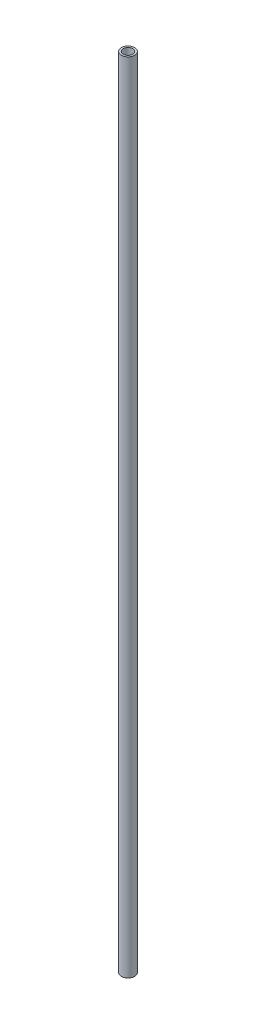
ISO-10303-21;
HEADER;
FILE_DESCRIPTION(('STEP AP214'),'2;1');
FILE_NAME('part.step','',(''),(''),'','','');
FILE_SCHEMA(('AUTOMOTIVE_DESIGN { 1 0 10303 214 1 1 1 1 }'));
ENDSEC;
DATA;
#1=APPLICATION_CONTEXT('core data for automotive mechanical design processes');
#2=APPLICATION_PROTOCOL_DEFINITION('international standard','automotive_design',2000,#1);
#3=PRODUCT_CONTEXT('',#1,'mechanical');
#4=PRODUCT('Part','Part','',(#3));
#5=PRODUCT_RELATED_PRODUCT_CATEGORY('part','',(#4));
#6=PRODUCT_DEFINITION_FORMATION('','',#4);
#7=PRODUCT_DEFINITION_CONTEXT('part definition',#1,'design');
#8=PRODUCT_DEFINITION('design','',#6,#7);
#9=PRODUCT_DEFINITION_SHAPE('','',#8);
#10=(LENGTH_UNIT() NAMED_UNIT(*) SI_UNIT(.MILLI.,.METRE.));
#11=(NAMED_UNIT(*) PLANE_ANGLE_UNIT() SI_UNIT($,.RADIAN.));
#12=(NAMED_UNIT(*) SI_UNIT($,.STERADIAN.) SOLID_ANGLE_UNIT());
#13=UNCERTAINTY_MEASURE_WITH_UNIT(LENGTH_MEASURE(1.E-05),#10,'distance_accuracy_value','');
#14=(GEOMETRIC_REPRESENTATION_CONTEXT(3) GLOBAL_UNCERTAINTY_ASSIGNED_CONTEXT((#13)) GLOBAL_UNIT_ASSIGNED_CONTEXT((#10,
#11,#12)) REPRESENTATION_CONTEXT('',''));
#15=CARTESIAN_POINT('',(0.,0.,0.));
#16=DIRECTION('',(0.,0.,1.));
#17=DIRECTION('',(1.,0.,0.));
#18=AXIS2_PLACEMENT_3D('',#15,#16,#17);
#19=CARTESIAN_POINT('',(0.,381.,0.));
#20=DIRECTION('',(0.,1.,0.));
#21=DIRECTION('',(0.,0.,1.));
#22=AXIS2_PLACEMENT_3D('',#19,#20,#21);
#23=PLANE('',#22);
#24=CARTESIAN_POINT('',(0.,381.,0.));
#25=DIRECTION('',(0.,1.,0.));
#26=DIRECTION('',(0.,0.,1.));
#27=AXIS2_PLACEMENT_3D('',#24,#25,#26);
#28=CIRCLE('',#27,3.175);
#29=CARTESIAN_POINT('',(0.,381.,3.175));
#30=VERTEX_POINT('',#29);
#31=EDGE_CURVE('E10',#30,#30,#28,.T.);
#32=ORIENTED_EDGE('',*,*,#31,.T.);
#33=EDGE_LOOP('',(#32));
#34=FACE_BOUND('',#33,.T.);
#35=CARTESIAN_POINT('',(0.,381.,0.));
#36=DIRECTION('',(0.,1.,0.));
#37=DIRECTION('',(0.,0.,1.));
#38=AXIS2_PLACEMENT_3D('',#35,#36,#37);
#39=CIRCLE('',#38,2.286);
#40=CARTESIAN_POINT('',(0.,381.,2.286));
#41=VERTEX_POINT('',#40);
#42=EDGE_CURVE('E47',#41,#41,#39,.T.);
#43=ORIENTED_EDGE('',*,*,#42,.F.);
#44=EDGE_LOOP('',(#43));
#45=FACE_BOUND('',#44,.T.);
#46=ADVANCED_FACE('F36',(#34,#45),#23,.T.);
#47=CARTESIAN_POINT('',(0.,0.,0.));
#48=DIRECTION('',(0.,1.,0.));
#49=DIRECTION('',(0.,0.,1.));
#50=AXIS2_PLACEMENT_3D('',#47,#48,#49);
#51=PLANE('',#50);
#52=CARTESIAN_POINT('',(0.,0.,0.));
#53=DIRECTION('',(0.,1.,0.));
#54=DIRECTION('',(0.,0.,1.));
#55=AXIS2_PLACEMENT_3D('',#52,#53,#54);
#56=CIRCLE('',#55,3.175);
#57=CARTESIAN_POINT('',(0.,0.,3.175));
#58=VERTEX_POINT('',#57);
#59=EDGE_CURVE('E40',#58,#58,#56,.T.);
#60=ORIENTED_EDGE('',*,*,#59,.F.);
#61=EDGE_LOOP('',(#60));
#62=FACE_BOUND('',#61,.T.);
#63=CARTESIAN_POINT('',(0.,0.,0.));
#64=DIRECTION('',(0.,1.,0.));
#65=DIRECTION('',(0.,0.,1.));
#66=AXIS2_PLACEMENT_3D('',#63,#64,#65);
#67=CIRCLE('',#66,2.286);
#68=CARTESIAN_POINT('',(0.,0.,2.286));
#69=VERTEX_POINT('',#68);
#70=EDGE_CURVE('E49',#69,#69,#67,.T.);
#71=ORIENTED_EDGE('',*,*,#70,.T.);
#72=EDGE_LOOP('',(#71));
#73=FACE_BOUND('',#72,.T.);
#74=ADVANCED_FACE('F59',(#62,#73),#51,.F.);
#75=CARTESIAN_POINT('',(0.,381.,0.));
#76=DIRECTION('',(0.,-1.,0.));
#77=DIRECTION('',(0.,0.,-1.));
#78=AXIS2_PLACEMENT_3D('',#75,#76,#77);
#79=CYLINDRICAL_SURFACE('',#78,3.175);
#80=ORIENTED_EDGE('',*,*,#31,.F.);
#81=EDGE_LOOP('',(#80));
#82=FACE_BOUND('',#81,.T.);
#83=ORIENTED_EDGE('',*,*,#59,.T.);
#84=EDGE_LOOP('',(#83));
#85=FACE_BOUND('',#84,.T.);
#86=ADVANCED_FACE('F38',(#82,#85),#79,.T.);
#87=CARTESIAN_POINT('',(0.,381.,0.));
#88=DIRECTION('',(0.,-1.,0.));
#89=DIRECTION('',(0.,0.,-1.));
#90=AXIS2_PLACEMENT_3D('',#87,#88,#89);
#91=CYLINDRICAL_SURFACE('',#90,2.286);
#92=ORIENTED_EDGE('',*,*,#42,.T.);
#93=EDGE_LOOP('',(#92));
#94=FACE_BOUND('',#93,.T.);
#95=ORIENTED_EDGE('',*,*,#70,.F.);
#96=EDGE_LOOP('',(#95));
#97=FACE_BOUND('',#96,.T.);
#98=ADVANCED_FACE('F55',(#94,#97),#91,.F.);
#99=CLOSED_SHELL('',(#46,#74,#86,#98));
#100=MANIFOLD_SOLID_BREP('B2',#99);
#101=ADVANCED_BREP_SHAPE_REPRESENTATION('',(#18,#100),#14);
#102=SHAPE_DEFINITION_REPRESENTATION(#9,#101);
ENDSEC;
END-ISO-10303-21;
